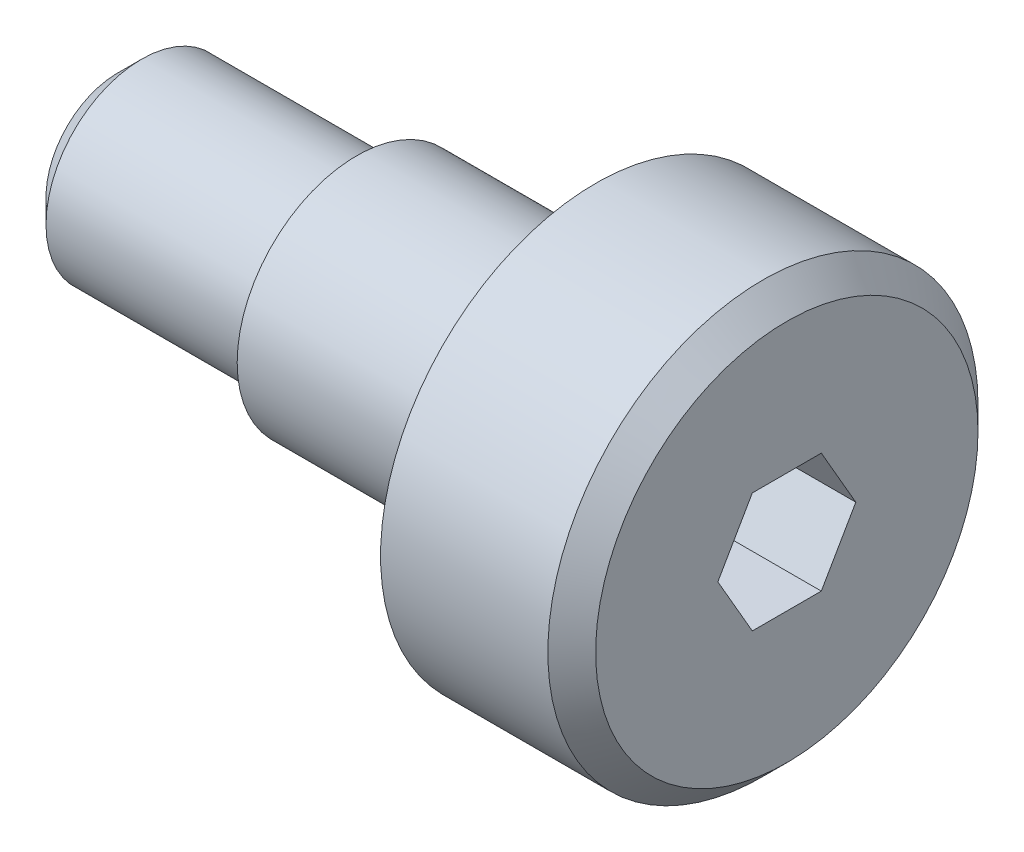
ISO-10303-21;
HEADER;
FILE_DESCRIPTION(('STEP AP214'),'2;1');
FILE_NAME('part.step','',(''),(''),'','','');
FILE_SCHEMA(('AUTOMOTIVE_DESIGN { 1 0 10303 214 1 1 1 1 }'));
ENDSEC;
DATA;
#1=APPLICATION_CONTEXT('core data for automotive mechanical design processes');
#2=APPLICATION_PROTOCOL_DEFINITION('international standard','automotive_design',2000,#1);
#3=PRODUCT_CONTEXT('',#1,'mechanical');
#4=PRODUCT('Part','Part','',(#3));
#5=PRODUCT_RELATED_PRODUCT_CATEGORY('part','',(#4));
#6=PRODUCT_DEFINITION_FORMATION('','',#4);
#7=PRODUCT_DEFINITION_CONTEXT('part definition',#1,'design');
#8=PRODUCT_DEFINITION('design','',#6,#7);
#9=PRODUCT_DEFINITION_SHAPE('','',#8);
#10=(LENGTH_UNIT() NAMED_UNIT(*) SI_UNIT(.MILLI.,.METRE.));
#11=(NAMED_UNIT(*) PLANE_ANGLE_UNIT() SI_UNIT($,.RADIAN.));
#12=(NAMED_UNIT(*) SI_UNIT($,.STERADIAN.) SOLID_ANGLE_UNIT());
#13=UNCERTAINTY_MEASURE_WITH_UNIT(LENGTH_MEASURE(1.E-05),#10,'distance_accuracy_value','');
#14=(GEOMETRIC_REPRESENTATION_CONTEXT(3) GLOBAL_UNCERTAINTY_ASSIGNED_CONTEXT((#13)) GLOBAL_UNIT_ASSIGNED_CONTEXT((#10,
#11,#12)) REPRESENTATION_CONTEXT('',''));
#15=CARTESIAN_POINT('',(0.,0.,0.));
#16=DIRECTION('',(0.,0.,1.));
#17=DIRECTION('',(1.,0.,0.));
#18=AXIS2_PLACEMENT_3D('',#15,#16,#17);
#19=CARTESIAN_POINT('',(0.,1.5,0.));
#20=DIRECTION('',(1.,0.,0.));
#21=DIRECTION('',(0.,0.,1.));
#22=AXIS2_PLACEMENT_3D('',#19,#20,#21);
#23=PLANE('',#22);
#24=CARTESIAN_POINT('',(0.,0.,0.));
#25=DIRECTION('',(1.,0.,0.));
#26=DIRECTION('',(0.,0.,-1.));
#27=AXIS2_PLACEMENT_3D('',#24,#25,#26);
#28=CIRCLE('',#27,1.5);
#29=CARTESIAN_POINT('',(0.,0.,-1.5));
#30=VERTEX_POINT('',#29);
#31=EDGE_CURVE('E131',#30,#30,#28,.T.);
#32=ORIENTED_EDGE('',*,*,#31,.F.);
#33=EDGE_LOOP('',(#32));
#34=FACE_BOUND('',#33,.T.);
#35=ADVANCED_FACE('F43',(#34),#23,.F.);
#36=CARTESIAN_POINT('',(14.,0.,0.));
#37=DIRECTION('',(-1.,0.,0.));
#38=DIRECTION('',(0.,0.,-1.));
#39=AXIS2_PLACEMENT_3D('',#36,#37,#38);
#40=PLANE('',#39);
#41=DIRECTION('',(0.,0.866025403784438,-0.5));
#42=VECTOR('',#41,1.);
#43=CARTESIAN_POINT('',(14.,0.,1.44337567297407));
#44=LINE('',#43,#42);
#45=CARTESIAN_POINT('',(14.,0.,1.44337567297407));
#46=VERTEX_POINT('',#45);
#47=CARTESIAN_POINT('',(14.,1.25,0.721687836487032));
#48=VERTEX_POINT('',#47);
#49=EDGE_CURVE('E325',#46,#48,#44,.T.);
#50=ORIENTED_EDGE('',*,*,#49,.T.);
#51=DIRECTION('',(0.,0.,-1.));
#52=VECTOR('',#51,1.);
#53=CARTESIAN_POINT('',(14.,1.25,0.721687836487032));
#54=LINE('',#53,#52);
#55=CARTESIAN_POINT('',(14.,1.25,-0.721687836487031));
#56=VERTEX_POINT('',#55);
#57=EDGE_CURVE('E321',#48,#56,#54,.T.);
#58=ORIENTED_EDGE('',*,*,#57,.T.);
#59=DIRECTION('',(0.,-0.866025403784438,-0.5));
#60=VECTOR('',#59,1.);
#61=CARTESIAN_POINT('',(14.,1.25,-0.721687836487031));
#62=LINE('',#61,#60);
#63=CARTESIAN_POINT('',(14.,0.,-1.44337567297406));
#64=VERTEX_POINT('',#63);
#65=EDGE_CURVE('E319',#56,#64,#62,.T.);
#66=ORIENTED_EDGE('',*,*,#65,.T.);
#67=DIRECTION('',(0.,-0.866025403784438,0.5));
#68=VECTOR('',#67,1.);
#69=CARTESIAN_POINT('',(14.,0.,-1.44337567297406));
#70=LINE('',#69,#68);
#71=CARTESIAN_POINT('',(14.,-1.25,-0.721687836487031));
#72=VERTEX_POINT('',#71);
#73=EDGE_CURVE('E120',#64,#72,#70,.T.);
#74=ORIENTED_EDGE('',*,*,#73,.T.);
#75=DIRECTION('',(0.,0.,1.));
#76=VECTOR('',#75,1.);
#77=CARTESIAN_POINT('',(14.,-1.25,-0.721687836487031));
#78=LINE('',#77,#76);
#79=CARTESIAN_POINT('',(14.,-1.25,0.721687836487033));
#80=VERTEX_POINT('',#79);
#81=EDGE_CURVE('E313',#72,#80,#78,.T.);
#82=ORIENTED_EDGE('',*,*,#81,.T.);
#83=DIRECTION('',(0.,0.866025403784439,0.5));
#84=VECTOR('',#83,1.);
#85=CARTESIAN_POINT('',(14.,-1.25,0.721687836487033));
#86=LINE('',#85,#84);
#87=EDGE_CURVE('E327',#80,#46,#86,.T.);
#88=ORIENTED_EDGE('',*,*,#87,.T.);
#89=EDGE_LOOP('',(#50,#58,#66,#74,#82,#88));
#90=FACE_BOUND('',#89,.T.);
#91=CARTESIAN_POINT('',(14.,0.,0.));
#92=DIRECTION('',(1.,0.,0.));
#93=DIRECTION('',(0.,0.,-1.));
#94=AXIS2_PLACEMENT_3D('',#91,#92,#93);
#95=CIRCLE('',#94,4.);
#96=CARTESIAN_POINT('',(14.,0.,-4.));
#97=VERTEX_POINT('',#96);
#98=EDGE_CURVE('E11',#97,#97,#95,.T.);
#99=ORIENTED_EDGE('',*,*,#98,.T.);
#100=EDGE_LOOP('',(#99));
#101=FACE_BOUND('',#100,.T.);
#102=ADVANCED_FACE('F166',(#90,#101),#40,.F.);
#103=CARTESIAN_POINT('',(14.,0.,0.));
#104=DIRECTION('',(-1.,0.,0.));
#105=DIRECTION('',(0.,0.,-1.));
#106=AXIS2_PLACEMENT_3D('',#103,#104,#105);
#107=CONICAL_SURFACE('',#106,4.,0.785398163397446);
#108=CARTESIAN_POINT('',(13.5,0.,0.));
#109=DIRECTION('',(1.,0.,0.));
#110=DIRECTION('',(0.,0.,-1.));
#111=AXIS2_PLACEMENT_3D('',#108,#109,#110);
#112=CIRCLE('',#111,4.5);
#113=CARTESIAN_POINT('',(13.5,0.,-4.5));
#114=VERTEX_POINT('',#113);
#115=EDGE_CURVE('E50',#114,#114,#112,.T.);
#116=ORIENTED_EDGE('',*,*,#115,.T.);
#117=EDGE_LOOP('',(#116));
#118=FACE_BOUND('',#117,.T.);
#119=ORIENTED_EDGE('',*,*,#98,.F.);
#120=EDGE_LOOP('',(#119));
#121=FACE_BOUND('',#120,.T.);
#122=ADVANCED_FACE('F151',(#118,#121),#107,.T.);
#123=CARTESIAN_POINT('',(0.,0.,0.));
#124=DIRECTION('',(-1.,0.,0.));
#125=DIRECTION('',(0.,0.,-1.));
#126=AXIS2_PLACEMENT_3D('',#123,#124,#125);
#127=CYLINDRICAL_SURFACE('',#126,4.5);
#128=CARTESIAN_POINT('',(10.,0.,0.));
#129=DIRECTION('',(1.,0.,0.));
#130=DIRECTION('',(0.,0.,-1.));
#131=AXIS2_PLACEMENT_3D('',#128,#129,#130);
#132=CIRCLE('',#131,4.5);
#133=CARTESIAN_POINT('',(10.,0.,-4.5));
#134=VERTEX_POINT('',#133);
#135=EDGE_CURVE('E146',#134,#134,#132,.T.);
#136=ORIENTED_EDGE('',*,*,#135,.T.);
#137=EDGE_LOOP('',(#136));
#138=FACE_BOUND('',#137,.T.);
#139=ORIENTED_EDGE('',*,*,#115,.F.);
#140=EDGE_LOOP('',(#139));
#141=FACE_BOUND('',#140,.T.);
#142=ADVANCED_FACE('F154',(#138,#141),#127,.T.);
#143=CARTESIAN_POINT('',(10.,4.5,0.));
#144=DIRECTION('',(1.,0.,0.));
#145=DIRECTION('',(0.,0.,1.));
#146=AXIS2_PLACEMENT_3D('',#143,#144,#145);
#147=PLANE('',#146);
#148=CARTESIAN_POINT('',(10.,0.,0.));
#149=DIRECTION('',(1.,0.,0.));
#150=DIRECTION('',(0.,0.,-1.));
#151=AXIS2_PLACEMENT_3D('',#148,#149,#150);
#152=CIRCLE('',#151,2.5);
#153=CARTESIAN_POINT('',(10.,0.,-2.5));
#154=VERTEX_POINT('',#153);
#155=EDGE_CURVE('E143',#154,#154,#152,.T.);
#156=ORIENTED_EDGE('',*,*,#155,.T.);
#157=EDGE_LOOP('',(#156));
#158=FACE_BOUND('',#157,.T.);
#159=ORIENTED_EDGE('',*,*,#135,.F.);
#160=EDGE_LOOP('',(#159));
#161=FACE_BOUND('',#160,.T.);
#162=ADVANCED_FACE('F156',(#158,#161),#147,.F.);
#163=CARTESIAN_POINT('',(0.,0.,0.));
#164=DIRECTION('',(-1.,0.,0.));
#165=DIRECTION('',(0.,0.,-1.));
#166=AXIS2_PLACEMENT_3D('',#163,#164,#165);
#167=CYLINDRICAL_SURFACE('',#166,2.5);
#168=CARTESIAN_POINT('',(5.,0.,0.));
#169=DIRECTION('',(1.,0.,0.));
#170=DIRECTION('',(0.,0.,-1.));
#171=AXIS2_PLACEMENT_3D('',#168,#169,#170);
#172=CIRCLE('',#171,2.5);
#173=CARTESIAN_POINT('',(5.,0.,-2.5));
#174=VERTEX_POINT('',#173);
#175=EDGE_CURVE('E140',#174,#174,#172,.T.);
#176=ORIENTED_EDGE('',*,*,#175,.T.);
#177=EDGE_LOOP('',(#176));
#178=FACE_BOUND('',#177,.T.);
#179=ORIENTED_EDGE('',*,*,#155,.F.);
#180=EDGE_LOOP('',(#179));
#181=FACE_BOUND('',#180,.T.);
#182=ADVANCED_FACE('F163',(#178,#181),#167,.T.);
#183=CARTESIAN_POINT('',(5.,2.5,0.));
#184=DIRECTION('',(1.,0.,0.));
#185=DIRECTION('',(0.,0.,1.));
#186=AXIS2_PLACEMENT_3D('',#183,#184,#185);
#187=PLANE('',#186);
#188=CARTESIAN_POINT('',(5.,0.,0.));
#189=DIRECTION('',(1.,0.,0.));
#190=DIRECTION('',(0.,0.,-1.));
#191=AXIS2_PLACEMENT_3D('',#188,#189,#190);
#192=CIRCLE('',#191,2.);
#193=CARTESIAN_POINT('',(5.,0.,-2.));
#194=VERTEX_POINT('',#193);
#195=EDGE_CURVE('E137',#194,#194,#192,.T.);
#196=ORIENTED_EDGE('',*,*,#195,.T.);
#197=EDGE_LOOP('',(#196));
#198=FACE_BOUND('',#197,.T.);
#199=ORIENTED_EDGE('',*,*,#175,.F.);
#200=EDGE_LOOP('',(#199));
#201=FACE_BOUND('',#200,.T.);
#202=ADVANCED_FACE('F186',(#198,#201),#187,.F.);
#203=CARTESIAN_POINT('',(0.,0.,0.));
#204=DIRECTION('',(-1.,0.,0.));
#205=DIRECTION('',(0.,0.,-1.));
#206=AXIS2_PLACEMENT_3D('',#203,#204,#205);
#207=CYLINDRICAL_SURFACE('',#206,2.);
#208=CARTESIAN_POINT('',(0.5,0.,0.));
#209=DIRECTION('',(1.,0.,0.));
#210=DIRECTION('',(0.,0.,-1.));
#211=AXIS2_PLACEMENT_3D('',#208,#209,#210);
#212=CIRCLE('',#211,2.);
#213=CARTESIAN_POINT('',(0.5,0.,-2.));
#214=VERTEX_POINT('',#213);
#215=EDGE_CURVE('E134',#214,#214,#212,.T.);
#216=ORIENTED_EDGE('',*,*,#215,.T.);
#217=EDGE_LOOP('',(#216));
#218=FACE_BOUND('',#217,.T.);
#219=ORIENTED_EDGE('',*,*,#195,.F.);
#220=EDGE_LOOP('',(#219));
#221=FACE_BOUND('',#220,.T.);
#222=ADVANCED_FACE('F180',(#218,#221),#207,.T.);
#223=CARTESIAN_POINT('',(0.5,0.,0.));
#224=DIRECTION('',(1.,0.,0.));
#225=DIRECTION('',(0.,0.,1.));
#226=AXIS2_PLACEMENT_3D('',#223,#224,#225);
#227=CONICAL_SURFACE('',#226,2.,0.785398163397448);
#228=ORIENTED_EDGE('',*,*,#31,.T.);
#229=EDGE_LOOP('',(#228));
#230=FACE_BOUND('',#229,.T.);
#231=ORIENTED_EDGE('',*,*,#215,.F.);
#232=EDGE_LOOP('',(#231));
#233=FACE_BOUND('',#232,.T.);
#234=ADVANCED_FACE('F176',(#230,#233),#227,.T.);
#235=CARTESIAN_POINT('',(10.,-1.25,0.721687836487033));
#236=DIRECTION('',(0.,-0.5,0.866025403784439));
#237=DIRECTION('',(0.,0.866025403784439,0.5));
#238=AXIS2_PLACEMENT_3D('',#235,#236,#237);
#239=PLANE('',#238);
#240=ORIENTED_EDGE('',*,*,#87,.F.);
#241=DIRECTION('',(1.,0.,0.));
#242=VECTOR('',#241,1.);
#243=CARTESIAN_POINT('',(10.,-1.25,0.721687836487033));
#244=LINE('',#243,#242);
#245=CARTESIAN_POINT('',(10.,-1.25,0.721687836487033));
#246=VERTEX_POINT('',#245);
#247=EDGE_CURVE('E88',#246,#80,#244,.T.);
#248=ORIENTED_EDGE('',*,*,#247,.F.);
#249=DIRECTION('',(0.,0.866025403784439,0.5));
#250=VECTOR('',#249,1.);
#251=CARTESIAN_POINT('',(10.,-1.25,0.721687836487033));
#252=LINE('',#251,#250);
#253=CARTESIAN_POINT('',(10.,0.,1.44337567297407));
#254=VERTEX_POINT('',#253);
#255=EDGE_CURVE('E314',#246,#254,#252,.T.);
#256=ORIENTED_EDGE('',*,*,#255,.T.);
#257=DIRECTION('',(1.,0.,0.));
#258=VECTOR('',#257,1.);
#259=CARTESIAN_POINT('',(10.,0.,1.44337567297407));
#260=LINE('',#259,#258);
#261=EDGE_CURVE('E57',#254,#46,#260,.T.);
#262=ORIENTED_EDGE('',*,*,#261,.T.);
#263=EDGE_LOOP('',(#240,#248,#256,#262));
#264=FACE_BOUND('',#263,.T.);
#265=ADVANCED_FACE('F179',(#264),#239,.F.);
#266=CARTESIAN_POINT('',(10.,-1.25,-0.721687836487031));
#267=DIRECTION('',(0.,-1.,0.));
#268=DIRECTION('',(0.,0.,1.));
#269=AXIS2_PLACEMENT_3D('',#266,#267,#268);
#270=PLANE('',#269);
#271=ORIENTED_EDGE('',*,*,#81,.F.);
#272=DIRECTION('',(1.,0.,0.));
#273=VECTOR('',#272,1.);
#274=CARTESIAN_POINT('',(10.,-1.25,-0.721687836487031));
#275=LINE('',#274,#273);
#276=CARTESIAN_POINT('',(10.,-1.25,-0.721687836487031));
#277=VERTEX_POINT('',#276);
#278=EDGE_CURVE('E122',#277,#72,#275,.T.);
#279=ORIENTED_EDGE('',*,*,#278,.F.);
#280=DIRECTION('',(0.,0.,1.));
#281=VECTOR('',#280,1.);
#282=CARTESIAN_POINT('',(10.,-1.25,-0.721687836487031));
#283=LINE('',#282,#281);
#284=EDGE_CURVE('E66',#277,#246,#283,.T.);
#285=ORIENTED_EDGE('',*,*,#284,.T.);
#286=ORIENTED_EDGE('',*,*,#247,.T.);
#287=EDGE_LOOP('',(#271,#279,#285,#286));
#288=FACE_BOUND('',#287,.T.);
#289=ADVANCED_FACE('F206',(#288),#270,.F.);
#290=CARTESIAN_POINT('',(10.,0.,-1.44337567297406));
#291=DIRECTION('',(0.,-0.5,-0.866025403784438));
#292=DIRECTION('',(0.,-0.866025403784438,0.5));
#293=AXIS2_PLACEMENT_3D('',#290,#291,#292);
#294=PLANE('',#293);
#295=ORIENTED_EDGE('',*,*,#73,.F.);
#296=DIRECTION('',(1.,0.,0.));
#297=VECTOR('',#296,1.);
#298=CARTESIAN_POINT('',(10.,0.,-1.44337567297406));
#299=LINE('',#298,#297);
#300=CARTESIAN_POINT('',(10.,0.,-1.44337567297406));
#301=VERTEX_POINT('',#300);
#302=EDGE_CURVE('E109',#301,#64,#299,.T.);
#303=ORIENTED_EDGE('',*,*,#302,.F.);
#304=DIRECTION('',(0.,-0.866025403784438,0.5));
#305=VECTOR('',#304,1.);
#306=CARTESIAN_POINT('',(10.,0.,-1.44337567297406));
#307=LINE('',#306,#305);
#308=EDGE_CURVE('E112',#301,#277,#307,.T.);
#309=ORIENTED_EDGE('',*,*,#308,.T.);
#310=ORIENTED_EDGE('',*,*,#278,.T.);
#311=EDGE_LOOP('',(#295,#303,#309,#310));
#312=FACE_BOUND('',#311,.T.);
#313=ADVANCED_FACE('F118',(#312),#294,.F.);
#314=CARTESIAN_POINT('',(10.,1.25,-0.721687836487031));
#315=DIRECTION('',(0.,0.5,-0.866025403784439));
#316=DIRECTION('',(0.,-0.866025403784438,-0.5));
#317=AXIS2_PLACEMENT_3D('',#314,#315,#316);
#318=PLANE('',#317);
#319=ORIENTED_EDGE('',*,*,#65,.F.);
#320=DIRECTION('',(1.,0.,0.));
#321=VECTOR('',#320,1.);
#322=CARTESIAN_POINT('',(10.,1.25,-0.721687836487031));
#323=LINE('',#322,#321);
#324=CARTESIAN_POINT('',(10.,1.25,-0.721687836487031));
#325=VERTEX_POINT('',#324);
#326=EDGE_CURVE('E111',#325,#56,#323,.T.);
#327=ORIENTED_EDGE('',*,*,#326,.F.);
#328=DIRECTION('',(0.,-0.866025403784438,-0.5));
#329=VECTOR('',#328,1.);
#330=CARTESIAN_POINT('',(10.,1.25,-0.721687836487031));
#331=LINE('',#330,#329);
#332=EDGE_CURVE('E104',#325,#301,#331,.T.);
#333=ORIENTED_EDGE('',*,*,#332,.T.);
#334=ORIENTED_EDGE('',*,*,#302,.T.);
#335=EDGE_LOOP('',(#319,#327,#333,#334));
#336=FACE_BOUND('',#335,.T.);
#337=ADVANCED_FACE('F107',(#336),#318,.F.);
#338=CARTESIAN_POINT('',(10.,1.25,0.721687836487032));
#339=DIRECTION('',(0.,1.,0.));
#340=DIRECTION('',(0.,0.,-1.));
#341=AXIS2_PLACEMENT_3D('',#338,#339,#340);
#342=PLANE('',#341);
#343=ORIENTED_EDGE('',*,*,#57,.F.);
#344=DIRECTION('',(1.,0.,0.));
#345=VECTOR('',#344,1.);
#346=CARTESIAN_POINT('',(10.,1.25,0.721687836487032));
#347=LINE('',#346,#345);
#348=CARTESIAN_POINT('',(10.,1.25,0.721687836487032));
#349=VERTEX_POINT('',#348);
#350=EDGE_CURVE('E125',#349,#48,#347,.T.);
#351=ORIENTED_EDGE('',*,*,#350,.F.);
#352=DIRECTION('',(0.,0.,-1.));
#353=VECTOR('',#352,1.);
#354=CARTESIAN_POINT('',(10.,1.25,0.721687836487032));
#355=LINE('',#354,#353);
#356=EDGE_CURVE('E113',#349,#325,#355,.T.);
#357=ORIENTED_EDGE('',*,*,#356,.T.);
#358=ORIENTED_EDGE('',*,*,#326,.T.);
#359=EDGE_LOOP('',(#343,#351,#357,#358));
#360=FACE_BOUND('',#359,.T.);
#361=ADVANCED_FACE('F210',(#360),#342,.F.);
#362=CARTESIAN_POINT('',(10.,0.,1.44337567297407));
#363=DIRECTION('',(0.,0.5,0.866025403784438));
#364=DIRECTION('',(0.,0.866025403784438,-0.5));
#365=AXIS2_PLACEMENT_3D('',#362,#363,#364);
#366=PLANE('',#365);
#367=ORIENTED_EDGE('',*,*,#49,.F.);
#368=ORIENTED_EDGE('',*,*,#261,.F.);
#369=DIRECTION('',(0.,0.866025403784438,-0.5));
#370=VECTOR('',#369,1.);
#371=CARTESIAN_POINT('',(10.,0.,1.44337567297407));
#372=LINE('',#371,#370);
#373=EDGE_CURVE('E95',#254,#349,#372,.T.);
#374=ORIENTED_EDGE('',*,*,#373,.T.);
#375=ORIENTED_EDGE('',*,*,#350,.T.);
#376=EDGE_LOOP('',(#367,#368,#374,#375));
#377=FACE_BOUND('',#376,.T.);
#378=ADVANCED_FACE('F207',(#377),#366,.F.);
#379=CARTESIAN_POINT('',(10.,0.,0.));
#380=DIRECTION('',(1.,0.,0.));
#381=DIRECTION('',(0.,0.,1.));
#382=AXIS2_PLACEMENT_3D('',#379,#380,#381);
#383=PLANE('',#382);
#384=ORIENTED_EDGE('',*,*,#255,.F.);
#385=ORIENTED_EDGE('',*,*,#284,.F.);
#386=ORIENTED_EDGE('',*,*,#308,.F.);
#387=ORIENTED_EDGE('',*,*,#332,.F.);
#388=ORIENTED_EDGE('',*,*,#356,.F.);
#389=ORIENTED_EDGE('',*,*,#373,.F.);
#390=EDGE_LOOP('',(#384,#385,#386,#387,#388,#389));
#391=FACE_BOUND('',#390,.T.);
#392=ADVANCED_FACE('F115',(#391),#383,.T.);
#393=CLOSED_SHELL('',(#35,#102,#122,#142,#162,#182,#202,#222,#234,#265,#289,#313,#337,#361,#378,#392));
#394=MANIFOLD_SOLID_BREP('B2',#393);
#395=ADVANCED_BREP_SHAPE_REPRESENTATION('',(#18,#394),#14);
#396=SHAPE_DEFINITION_REPRESENTATION(#9,#395);
ENDSEC;
END-ISO-10303-21;
